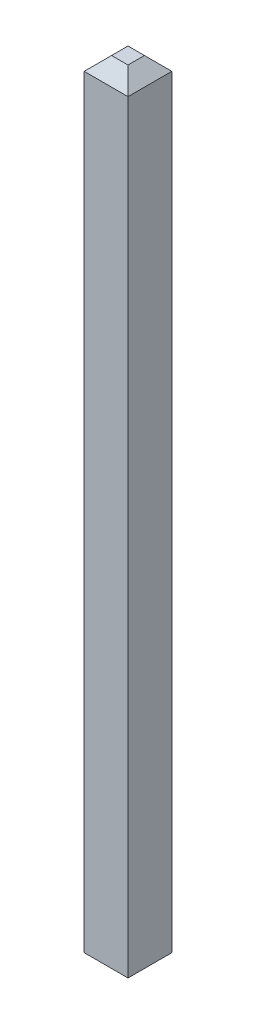
ISO-10303-21;
HEADER;
FILE_DESCRIPTION(('STEP AP214'),'2;1');
FILE_NAME('part.step','',(''),(''),'','','');
FILE_SCHEMA(('AUTOMOTIVE_DESIGN { 1 0 10303 214 1 1 1 1 }'));
ENDSEC;
DATA;
#1=APPLICATION_CONTEXT('core data for automotive mechanical design processes');
#2=APPLICATION_PROTOCOL_DEFINITION('international standard','automotive_design',2000,#1);
#3=PRODUCT_CONTEXT('',#1,'mechanical');
#4=PRODUCT('Part','Part','',(#3));
#5=PRODUCT_RELATED_PRODUCT_CATEGORY('part','',(#4));
#6=PRODUCT_DEFINITION_FORMATION('','',#4);
#7=PRODUCT_DEFINITION_CONTEXT('part definition',#1,'design');
#8=PRODUCT_DEFINITION('design','',#6,#7);
#9=PRODUCT_DEFINITION_SHAPE('','',#8);
#10=(LENGTH_UNIT() NAMED_UNIT(*) SI_UNIT(.MILLI.,.METRE.));
#11=(NAMED_UNIT(*) PLANE_ANGLE_UNIT() SI_UNIT($,.RADIAN.));
#12=(NAMED_UNIT(*) SI_UNIT($,.STERADIAN.) SOLID_ANGLE_UNIT());
#13=UNCERTAINTY_MEASURE_WITH_UNIT(LENGTH_MEASURE(1.E-05),#10,'distance_accuracy_value','');
#14=(GEOMETRIC_REPRESENTATION_CONTEXT(3) GLOBAL_UNCERTAINTY_ASSIGNED_CONTEXT((#13)) GLOBAL_UNIT_ASSIGNED_CONTEXT((#10,
#11,#12)) REPRESENTATION_CONTEXT('',''));
#15=CARTESIAN_POINT('',(0.,0.,0.));
#16=DIRECTION('',(0.,0.,1.));
#17=DIRECTION('',(1.,0.,0.));
#18=AXIS2_PLACEMENT_3D('',#15,#16,#17);
#19=CARTESIAN_POINT('',(-4.76,7.07,-0.32));
#20=DIRECTION('',(-0.707106781186549,-0.707106781186546,0.));
#21=DIRECTION('',(-0.707106781186546,0.707106781186549,0.));
#22=AXIS2_PLACEMENT_3D('',#19,#20,#21);
#23=PLANE('',#22);
#24=DIRECTION('',(0.577350269189625,-0.577350269189627,0.577350269189625));
#25=VECTOR('',#24,1.);
#26=CARTESIAN_POINT('',(-4.97333333333334,7.28333333333334,0.106666666666668));
#27=LINE('',#26,#25);
#28=CARTESIAN_POINT('',(-4.96,7.27,0.12));
#29=VERTEX_POINT('',#28);
#30=CARTESIAN_POINT('',(-4.76,7.07,0.32));
#31=VERTEX_POINT('',#30);
#32=EDGE_CURVE('E179',#29,#31,#27,.T.);
#33=ORIENTED_EDGE('',*,*,#32,.T.);
#34=DIRECTION('',(0.,0.,1.));
#35=VECTOR('',#34,1.);
#36=CARTESIAN_POINT('',(-4.76,7.07,-0.32));
#37=LINE('',#36,#35);
#38=CARTESIAN_POINT('',(-4.76,7.07,-0.32));
#39=VERTEX_POINT('',#38);
#40=EDGE_CURVE('E81',#39,#31,#37,.T.);
#41=ORIENTED_EDGE('',*,*,#40,.F.);
#42=DIRECTION('',(0.577350269189625,-0.577350269189627,-0.577350269189625));
#43=VECTOR('',#42,1.);
#44=CARTESIAN_POINT('',(-4.76,7.07,-0.32));
#45=LINE('',#44,#43);
#46=CARTESIAN_POINT('',(-4.96,7.27,-0.12));
#47=VERTEX_POINT('',#46);
#48=EDGE_CURVE('E11',#47,#39,#45,.T.);
#49=ORIENTED_EDGE('',*,*,#48,.F.);
#50=DIRECTION('',(0.,0.,-1.));
#51=VECTOR('',#50,1.);
#52=CARTESIAN_POINT('',(-4.96,7.27,-0.32));
#53=LINE('',#52,#51);
#54=EDGE_CURVE('E79',#29,#47,#53,.T.);
#55=ORIENTED_EDGE('',*,*,#54,.F.);
#56=EDGE_LOOP('',(#33,#41,#49,#55));
#57=FACE_BOUND('',#56,.T.);
#58=ADVANCED_FACE('F17',(#57),#23,.F.);
#59=CARTESIAN_POINT('',(-5.08,7.07,-0.32));
#60=DIRECTION('',(0.,0.707106781186548,-0.707106781186547));
#61=DIRECTION('',(-1.,0.,0.));
#62=AXIS2_PLACEMENT_3D('',#59,#60,#61);
#63=PLANE('',#62);
#64=DIRECTION('',(0.577350269189625,0.577350269189623,0.577350269189629));
#65=VECTOR('',#64,1.);
#66=CARTESIAN_POINT('',(-5.26666666666667,7.20333333333334,-0.186666666666667));
#67=LINE('',#66,#65);
#68=CARTESIAN_POINT('',(-5.4,7.07,-0.32));
#69=VERTEX_POINT('',#68);
#70=CARTESIAN_POINT('',(-5.2,7.27,-0.12));
#71=VERTEX_POINT('',#70);
#72=EDGE_CURVE('E27',#69,#71,#67,.T.);
#73=ORIENTED_EDGE('',*,*,#72,.T.);
#74=DIRECTION('',(-1.,0.,0.));
#75=VECTOR('',#74,1.);
#76=CARTESIAN_POINT('',(-5.4,7.27,-0.12));
#77=LINE('',#76,#75);
#78=EDGE_CURVE('E86',#47,#71,#77,.T.);
#79=ORIENTED_EDGE('',*,*,#78,.F.);
#80=ORIENTED_EDGE('',*,*,#48,.T.);
#81=DIRECTION('',(1.,0.,0.));
#82=VECTOR('',#81,1.);
#83=CARTESIAN_POINT('',(-4.76,7.07,-0.32));
#84=LINE('',#83,#82);
#85=EDGE_CURVE('E144',#69,#39,#84,.T.);
#86=ORIENTED_EDGE('',*,*,#85,.F.);
#87=EDGE_LOOP('',(#73,#79,#80,#86));
#88=FACE_BOUND('',#87,.T.);
#89=ADVANCED_FACE('F19',(#88),#63,.T.);
#90=CARTESIAN_POINT('',(-5.2,7.27,-0.32));
#91=DIRECTION('',(0.707106781186547,-0.707106781186548,0.));
#92=DIRECTION('',(0.,0.,-1.));
#93=AXIS2_PLACEMENT_3D('',#90,#91,#92);
#94=PLANE('',#93);
#95=DIRECTION('',(0.577350269189625,0.577350269189624,-0.577350269189629));
#96=VECTOR('',#95,1.);
#97=CARTESIAN_POINT('',(-5.26666666666667,7.20333333333334,0.186666666666669));
#98=LINE('',#97,#96);
#99=CARTESIAN_POINT('',(-5.4,7.07,0.32));
#100=VERTEX_POINT('',#99);
#101=CARTESIAN_POINT('',(-5.2,7.27,0.12));
#102=VERTEX_POINT('',#101);
#103=EDGE_CURVE('E39',#100,#102,#98,.T.);
#104=ORIENTED_EDGE('',*,*,#103,.T.);
#105=DIRECTION('',(0.,0.,1.));
#106=VECTOR('',#105,1.);
#107=CARTESIAN_POINT('',(-5.2,7.27,-0.32));
#108=LINE('',#107,#106);
#109=EDGE_CURVE('E90',#71,#102,#108,.T.);
#110=ORIENTED_EDGE('',*,*,#109,.F.);
#111=ORIENTED_EDGE('',*,*,#72,.F.);
#112=DIRECTION('',(0.,0.,-1.));
#113=VECTOR('',#112,1.);
#114=CARTESIAN_POINT('',(-5.4,7.07,-0.32));
#115=LINE('',#114,#113);
#116=EDGE_CURVE('E115',#100,#69,#115,.T.);
#117=ORIENTED_EDGE('',*,*,#116,.F.);
#118=EDGE_LOOP('',(#104,#110,#111,#117));
#119=FACE_BOUND('',#118,.T.);
#120=ADVANCED_FACE('F306',(#119),#94,.F.);
#121=CARTESIAN_POINT('',(-5.4,7.27,0.12));
#122=DIRECTION('',(0.,-0.707106781186548,-0.707106781186547));
#123=DIRECTION('',(0.,0.707106781186547,-0.707106781186548));
#124=AXIS2_PLACEMENT_3D('',#121,#122,#123);
#125=PLANE('',#124);
#126=ORIENTED_EDGE('',*,*,#32,.F.);
#127=DIRECTION('',(1.,0.,0.));
#128=VECTOR('',#127,1.);
#129=CARTESIAN_POINT('',(-5.4,7.27,0.12));
#130=LINE('',#129,#128);
#131=EDGE_CURVE('E94',#102,#29,#130,.T.);
#132=ORIENTED_EDGE('',*,*,#131,.F.);
#133=ORIENTED_EDGE('',*,*,#103,.F.);
#134=DIRECTION('',(-1.,0.,0.));
#135=VECTOR('',#134,1.);
#136=CARTESIAN_POINT('',(-5.08,7.07,0.32));
#137=LINE('',#136,#135);
#138=EDGE_CURVE('E101',#31,#100,#137,.T.);
#139=ORIENTED_EDGE('',*,*,#138,.F.);
#140=EDGE_LOOP('',(#126,#132,#133,#139));
#141=FACE_BOUND('',#140,.T.);
#142=ADVANCED_FACE('F287',(#141),#125,.F.);
#143=CARTESIAN_POINT('',(-5.4,7.27,-0.32));
#144=DIRECTION('',(0.,-1.,0.));
#145=DIRECTION('',(0.,0.,-1.));
#146=AXIS2_PLACEMENT_3D('',#143,#144,#145);
#147=PLANE('',#146);
#148=ORIENTED_EDGE('',*,*,#54,.T.);
#149=ORIENTED_EDGE('',*,*,#78,.T.);
#150=ORIENTED_EDGE('',*,*,#109,.T.);
#151=ORIENTED_EDGE('',*,*,#131,.T.);
#152=EDGE_LOOP('',(#148,#149,#150,#151));
#153=FACE_BOUND('',#152,.T.);
#154=ADVANCED_FACE('F93',(#153),#147,.F.);
#155=CARTESIAN_POINT('',(-4.76,7.27,-0.32));
#156=DIRECTION('',(-1.,0.,0.));
#157=DIRECTION('',(0.,1.,0.));
#158=AXIS2_PLACEMENT_3D('',#155,#156,#157);
#159=PLANE('',#158);
#160=DIRECTION('',(0.,-1.,0.));
#161=VECTOR('',#160,1.);
#162=CARTESIAN_POINT('',(-4.76,7.27,-0.32));
#163=LINE('',#162,#161);
#164=CARTESIAN_POINT('',(-4.76,-4.07,-0.32));
#165=VERTEX_POINT('',#164);
#166=EDGE_CURVE('E155',#39,#165,#163,.T.);
#167=ORIENTED_EDGE('',*,*,#166,.F.);
#168=ORIENTED_EDGE('',*,*,#40,.T.);
#169=DIRECTION('',(0.,-1.,0.));
#170=VECTOR('',#169,1.);
#171=CARTESIAN_POINT('',(-4.76,7.27,0.32));
#172=LINE('',#171,#170);
#173=CARTESIAN_POINT('',(-4.76,-4.07,0.32));
#174=VERTEX_POINT('',#173);
#175=EDGE_CURVE('E131',#31,#174,#172,.T.);
#176=ORIENTED_EDGE('',*,*,#175,.T.);
#177=DIRECTION('',(0.,0.,-1.));
#178=VECTOR('',#177,1.);
#179=CARTESIAN_POINT('',(-4.76,-4.07,-0.32));
#180=LINE('',#179,#178);
#181=EDGE_CURVE('E166',#174,#165,#180,.T.);
#182=ORIENTED_EDGE('',*,*,#181,.T.);
#183=EDGE_LOOP('',(#167,#168,#176,#182));
#184=FACE_BOUND('',#183,.T.);
#185=ADVANCED_FACE('F275',(#184),#159,.F.);
#186=CARTESIAN_POINT('',(-5.08,1.5,0.32));
#187=DIRECTION('',(0.,0.,-1.));
#188=DIRECTION('',(0.,-1.,0.));
#189=AXIS2_PLACEMENT_3D('',#186,#187,#188);
#190=PLANE('',#189);
#191=ORIENTED_EDGE('',*,*,#175,.F.);
#192=ORIENTED_EDGE('',*,*,#138,.T.);
#193=DIRECTION('',(0.,1.,0.));
#194=VECTOR('',#193,1.);
#195=CARTESIAN_POINT('',(-5.4,-4.27,0.32));
#196=LINE('',#195,#194);
#197=CARTESIAN_POINT('',(-5.4,-4.07,0.32));
#198=VERTEX_POINT('',#197);
#199=EDGE_CURVE('E139',#198,#100,#196,.T.);
#200=ORIENTED_EDGE('',*,*,#199,.F.);
#201=DIRECTION('',(1.,0.,0.));
#202=VECTOR('',#201,1.);
#203=CARTESIAN_POINT('',(-5.08,-4.07,0.32));
#204=LINE('',#203,#202);
#205=EDGE_CURVE('E162',#198,#174,#204,.T.);
#206=ORIENTED_EDGE('',*,*,#205,.T.);
#207=EDGE_LOOP('',(#191,#192,#200,#206));
#208=FACE_BOUND('',#207,.T.);
#209=ADVANCED_FACE('F223',(#208),#190,.F.);
#210=CARTESIAN_POINT('',(-4.96,-4.27,-0.32));
#211=DIRECTION('',(-0.707106781186553,0.707106781186542,0.));
#212=DIRECTION('',(0.,0.,1.));
#213=AXIS2_PLACEMENT_3D('',#210,#211,#212);
#214=PLANE('',#213);
#215=DIRECTION('',(0.57735026918962,0.577350269189629,-0.577350269189629));
#216=VECTOR('',#215,1.);
#217=CARTESIAN_POINT('',(-4.89333333333333,-4.20333333333333,-0.186666666666669));
#218=LINE('',#217,#216);
#219=CARTESIAN_POINT('',(-4.96,-4.27,-0.12));
#220=VERTEX_POINT('',#219);
#221=EDGE_CURVE('E145',#220,#165,#218,.T.);
#222=ORIENTED_EDGE('',*,*,#221,.T.);
#223=ORIENTED_EDGE('',*,*,#181,.F.);
#224=DIRECTION('',(0.57735026918962,0.577350269189628,0.577350269189629));
#225=VECTOR('',#224,1.);
#226=CARTESIAN_POINT('',(-5.10666666666666,-4.41666666666667,-0.0266666666666693));
#227=LINE('',#226,#225);
#228=CARTESIAN_POINT('',(-4.96,-4.27,0.12));
#229=VERTEX_POINT('',#228);
#230=EDGE_CURVE('E127',#229,#174,#227,.T.);
#231=ORIENTED_EDGE('',*,*,#230,.F.);
#232=DIRECTION('',(0.,0.,1.));
#233=VECTOR('',#232,1.);
#234=CARTESIAN_POINT('',(-4.96,-4.27,-0.32));
#235=LINE('',#234,#233);
#236=EDGE_CURVE('E105',#220,#229,#235,.T.);
#237=ORIENTED_EDGE('',*,*,#236,.F.);
#238=EDGE_LOOP('',(#222,#223,#231,#237));
#239=FACE_BOUND('',#238,.T.);
#240=ADVANCED_FACE('F217',(#239),#214,.F.);
#241=CARTESIAN_POINT('',(-4.76,-4.27,0.12));
#242=DIRECTION('',(0.,0.707106781186548,-0.707106781186547));
#243=DIRECTION('',(-1.,0.,0.));
#244=AXIS2_PLACEMENT_3D('',#241,#242,#243);
#245=PLANE('',#244);
#246=ORIENTED_EDGE('',*,*,#230,.T.);
#247=ORIENTED_EDGE('',*,*,#205,.F.);
#248=DIRECTION('',(0.577350269189627,-0.577350269189624,-0.577350269189626));
#249=VECTOR('',#248,1.);
#250=CARTESIAN_POINT('',(-5.18666666666665,-4.28333333333333,0.106666666666665));
#251=LINE('',#250,#249);
#252=CARTESIAN_POINT('',(-5.2,-4.27,0.12));
#253=VERTEX_POINT('',#252);
#254=EDGE_CURVE('E114',#198,#253,#251,.T.);
#255=ORIENTED_EDGE('',*,*,#254,.T.);
#256=DIRECTION('',(-1.,0.,0.));
#257=VECTOR('',#256,1.);
#258=CARTESIAN_POINT('',(-4.76,-4.27,0.12));
#259=LINE('',#258,#257);
#260=EDGE_CURVE('E106',#229,#253,#259,.T.);
#261=ORIENTED_EDGE('',*,*,#260,.F.);
#262=EDGE_LOOP('',(#246,#247,#255,#261));
#263=FACE_BOUND('',#262,.T.);
#264=ADVANCED_FACE('F222',(#263),#245,.F.);
#265=CARTESIAN_POINT('',(-5.4,-4.07,-0.32));
#266=DIRECTION('',(0.707106781186546,0.707106781186549,0.));
#267=DIRECTION('',(0.,0.,-1.));
#268=AXIS2_PLACEMENT_3D('',#265,#266,#267);
#269=PLANE('',#268);
#270=DIRECTION('',(0.577350269189627,-0.577350269189625,0.577350269189626));
#271=VECTOR('',#270,1.);
#272=CARTESIAN_POINT('',(-5.29333333333332,-4.17666666666666,-0.213333333333337));
#273=LINE('',#272,#271);
#274=CARTESIAN_POINT('',(-5.4,-4.07,-0.32));
#275=VERTEX_POINT('',#274);
#276=CARTESIAN_POINT('',(-5.2,-4.27,-0.12));
#277=VERTEX_POINT('',#276);
#278=EDGE_CURVE('E123',#275,#277,#273,.T.);
#279=ORIENTED_EDGE('',*,*,#278,.T.);
#280=DIRECTION('',(0.,0.,-1.));
#281=VECTOR('',#280,1.);
#282=CARTESIAN_POINT('',(-5.2,-4.27,-0.32));
#283=LINE('',#282,#281);
#284=EDGE_CURVE('E109',#253,#277,#283,.T.);
#285=ORIENTED_EDGE('',*,*,#284,.F.);
#286=ORIENTED_EDGE('',*,*,#254,.F.);
#287=DIRECTION('',(0.,0.,1.));
#288=VECTOR('',#287,1.);
#289=CARTESIAN_POINT('',(-5.4,-4.07,-0.32));
#290=LINE('',#289,#288);
#291=EDGE_CURVE('E110',#275,#198,#290,.T.);
#292=ORIENTED_EDGE('',*,*,#291,.F.);
#293=EDGE_LOOP('',(#279,#285,#286,#292));
#294=FACE_BOUND('',#293,.T.);
#295=ADVANCED_FACE('F246',(#294),#269,.F.);
#296=CARTESIAN_POINT('',(-5.4,-4.27,-0.32));
#297=DIRECTION('',(1.,0.,0.));
#298=DIRECTION('',(0.,0.,1.));
#299=AXIS2_PLACEMENT_3D('',#296,#297,#298);
#300=PLANE('',#299);
#301=ORIENTED_EDGE('',*,*,#199,.T.);
#302=ORIENTED_EDGE('',*,*,#116,.T.);
#303=DIRECTION('',(0.,1.,0.));
#304=VECTOR('',#303,1.);
#305=CARTESIAN_POINT('',(-5.4,-4.27,-0.32));
#306=LINE('',#305,#304);
#307=EDGE_CURVE('E140',#275,#69,#306,.T.);
#308=ORIENTED_EDGE('',*,*,#307,.F.);
#309=ORIENTED_EDGE('',*,*,#291,.T.);
#310=EDGE_LOOP('',(#301,#302,#308,#309));
#311=FACE_BOUND('',#310,.T.);
#312=ADVANCED_FACE('F235',(#311),#300,.F.);
#313=CARTESIAN_POINT('',(-5.08,1.5,-0.32));
#314=DIRECTION('',(0.,0.,-1.));
#315=DIRECTION('',(0.,-1.,0.));
#316=AXIS2_PLACEMENT_3D('',#313,#314,#315);
#317=PLANE('',#316);
#318=ORIENTED_EDGE('',*,*,#307,.T.);
#319=ORIENTED_EDGE('',*,*,#85,.T.);
#320=ORIENTED_EDGE('',*,*,#166,.T.);
#321=DIRECTION('',(-1.,0.,0.));
#322=VECTOR('',#321,1.);
#323=CARTESIAN_POINT('',(-5.4,-4.07,-0.32));
#324=LINE('',#323,#322);
#325=EDGE_CURVE('E135',#165,#275,#324,.T.);
#326=ORIENTED_EDGE('',*,*,#325,.T.);
#327=EDGE_LOOP('',(#318,#319,#320,#326));
#328=FACE_BOUND('',#327,.T.);
#329=ADVANCED_FACE('F209',(#328),#317,.T.);
#330=CARTESIAN_POINT('',(-5.08,-4.07,-0.32));
#331=DIRECTION('',(0.,-0.707106781186548,-0.707106781186547));
#332=DIRECTION('',(0.,0.707106781186547,-0.707106781186548));
#333=AXIS2_PLACEMENT_3D('',#330,#331,#332);
#334=PLANE('',#333);
#335=ORIENTED_EDGE('',*,*,#278,.F.);
#336=ORIENTED_EDGE('',*,*,#325,.F.);
#337=ORIENTED_EDGE('',*,*,#221,.F.);
#338=DIRECTION('',(1.,0.,0.));
#339=VECTOR('',#338,1.);
#340=CARTESIAN_POINT('',(-4.76,-4.27,-0.12));
#341=LINE('',#340,#339);
#342=EDGE_CURVE('E119',#277,#220,#341,.T.);
#343=ORIENTED_EDGE('',*,*,#342,.F.);
#344=EDGE_LOOP('',(#335,#336,#337,#343));
#345=FACE_BOUND('',#344,.T.);
#346=ADVANCED_FACE('F196',(#345),#334,.T.);
#347=CARTESIAN_POINT('',(-4.76,-4.27,-0.32));
#348=DIRECTION('',(0.,1.,0.));
#349=DIRECTION('',(0.,0.,-1.));
#350=AXIS2_PLACEMENT_3D('',#347,#348,#349);
#351=PLANE('',#350);
#352=ORIENTED_EDGE('',*,*,#236,.T.);
#353=ORIENTED_EDGE('',*,*,#260,.T.);
#354=ORIENTED_EDGE('',*,*,#284,.T.);
#355=ORIENTED_EDGE('',*,*,#342,.T.);
#356=EDGE_LOOP('',(#352,#353,#354,#355));
#357=FACE_BOUND('',#356,.T.);
#358=ADVANCED_FACE('F190',(#357),#351,.F.);
#359=CLOSED_SHELL('',(#58,#89,#120,#142,#154,#185,#209,#240,#264,#295,#312,#329,#346,#358));
#360=MANIFOLD_SOLID_BREP('B1',#359);
#361=ADVANCED_BREP_SHAPE_REPRESENTATION('',(#18,#360),#14);
#362=SHAPE_DEFINITION_REPRESENTATION(#9,#361);
ENDSEC;
END-ISO-10303-21;
